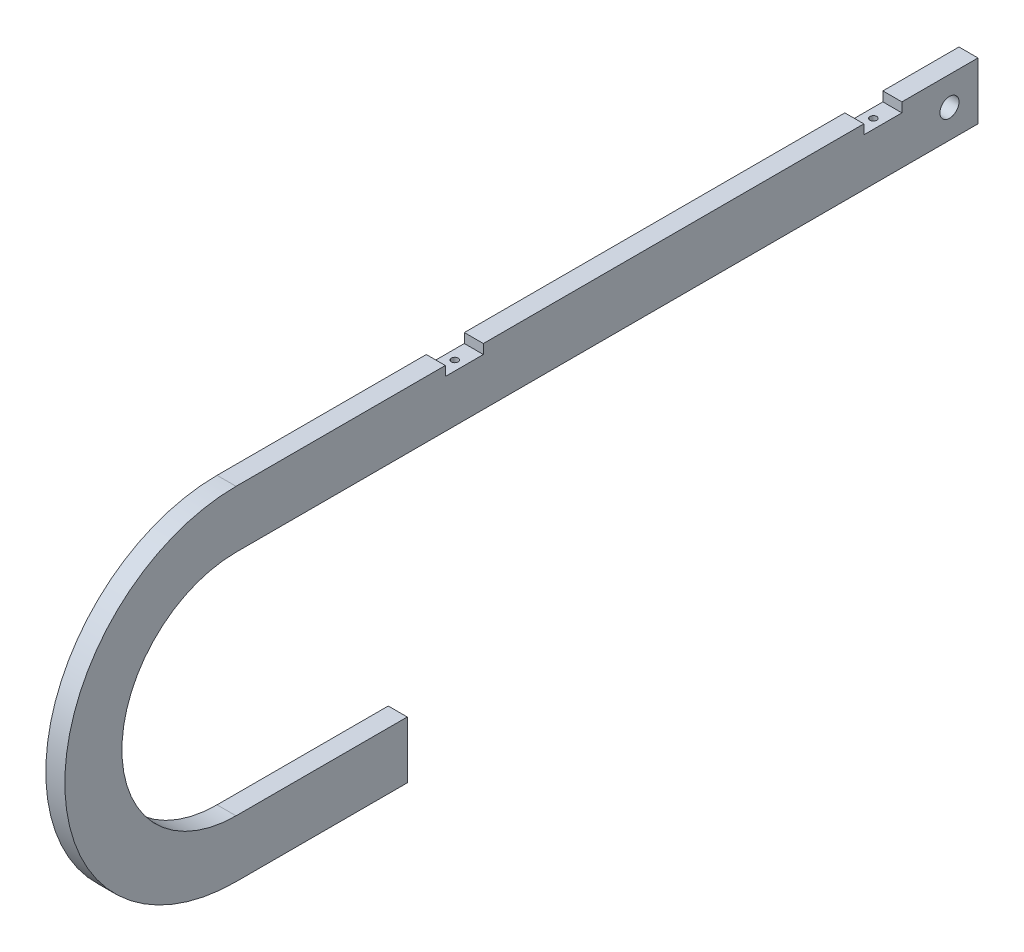
ISO-10303-21;
HEADER;
FILE_DESCRIPTION(('STEP AP214'),'2;1');
FILE_NAME('part.step','',(''),(''),'','','');
FILE_SCHEMA(('AUTOMOTIVE_DESIGN { 1 0 10303 214 1 1 1 1 }'));
ENDSEC;
DATA;
#1=APPLICATION_CONTEXT('core data for automotive mechanical design processes');
#2=APPLICATION_PROTOCOL_DEFINITION('international standard','automotive_design',2000,#1);
#3=PRODUCT_CONTEXT('',#1,'mechanical');
#4=PRODUCT('Part','Part','',(#3));
#5=PRODUCT_RELATED_PRODUCT_CATEGORY('part','',(#4));
#6=PRODUCT_DEFINITION_FORMATION('','',#4);
#7=PRODUCT_DEFINITION_CONTEXT('part definition',#1,'design');
#8=PRODUCT_DEFINITION('design','',#6,#7);
#9=PRODUCT_DEFINITION_SHAPE('','',#8);
#10=(LENGTH_UNIT() NAMED_UNIT(*) SI_UNIT(.MILLI.,.METRE.));
#11=(NAMED_UNIT(*) PLANE_ANGLE_UNIT() SI_UNIT($,.RADIAN.));
#12=(NAMED_UNIT(*) SI_UNIT($,.STERADIAN.) SOLID_ANGLE_UNIT());
#13=UNCERTAINTY_MEASURE_WITH_UNIT(LENGTH_MEASURE(1.E-05),#10,'distance_accuracy_value','');
#14=(GEOMETRIC_REPRESENTATION_CONTEXT(3) GLOBAL_UNCERTAINTY_ASSIGNED_CONTEXT((#13)) GLOBAL_UNIT_ASSIGNED_CONTEXT((#10,
#11,#12)) REPRESENTATION_CONTEXT('',''));
#15=CARTESIAN_POINT('',(0.,0.,0.));
#16=DIRECTION('',(0.,0.,1.));
#17=DIRECTION('',(1.,0.,0.));
#18=AXIS2_PLACEMENT_3D('',#15,#16,#17);
#19=CARTESIAN_POINT('',(3.175,0.,0.));
#20=DIRECTION('',(-1.,0.,0.));
#21=DIRECTION('',(0.,0.,1.));
#22=AXIS2_PLACEMENT_3D('',#19,#20,#21);
#23=CYLINDRICAL_SURFACE('',#22,57.15);
#24=CARTESIAN_POINT('',(-3.175,0.,0.));
#25=DIRECTION('',(1.,0.,0.));
#26=DIRECTION('',(0.,0.,-1.));
#27=AXIS2_PLACEMENT_3D('',#24,#25,#26);
#28=CIRCLE('',#27,57.15);
#29=CARTESIAN_POINT('',(-3.175,-57.15,0.));
#30=VERTEX_POINT('',#29);
#31=CARTESIAN_POINT('',(-3.175,57.15,0.));
#32=VERTEX_POINT('',#31);
#33=EDGE_CURVE('E225',#30,#32,#28,.F.);
#34=ORIENTED_EDGE('',*,*,#33,.F.);
#35=DIRECTION('',(-1.,0.,0.));
#36=VECTOR('',#35,1.);
#37=CARTESIAN_POINT('',(3.175,-57.15,0.));
#38=LINE('',#37,#36);
#39=CARTESIAN_POINT('',(3.175,-57.15,0.));
#40=VERTEX_POINT('',#39);
#41=EDGE_CURVE('E11',#40,#30,#38,.T.);
#42=ORIENTED_EDGE('',*,*,#41,.F.);
#43=CARTESIAN_POINT('',(3.175,0.,0.));
#44=DIRECTION('',(1.,0.,0.));
#45=DIRECTION('',(0.,0.,-1.));
#46=AXIS2_PLACEMENT_3D('',#43,#44,#45);
#47=CIRCLE('',#46,57.15);
#48=CARTESIAN_POINT('',(3.175,57.15,0.));
#49=VERTEX_POINT('',#48);
#50=EDGE_CURVE('E292',#40,#49,#47,.F.);
#51=ORIENTED_EDGE('',*,*,#50,.T.);
#52=DIRECTION('',(-1.,0.,0.));
#53=VECTOR('',#52,1.);
#54=CARTESIAN_POINT('',(3.175,57.15,0.));
#55=LINE('',#54,#53);
#56=EDGE_CURVE('E57',#49,#32,#55,.T.);
#57=ORIENTED_EDGE('',*,*,#56,.T.);
#58=EDGE_LOOP('',(#34,#42,#51,#57));
#59=FACE_BOUND('',#58,.T.);
#60=ADVANCED_FACE('F40',(#59),#23,.T.);
#61=CARTESIAN_POINT('',(3.175,-57.15,0.));
#62=DIRECTION('',(0.,-1.,0.));
#63=DIRECTION('',(0.,0.,-1.));
#64=AXIS2_PLACEMENT_3D('',#61,#62,#63);
#65=PLANE('',#64);
#66=DIRECTION('',(0.,0.,1.));
#67=VECTOR('',#66,1.);
#68=CARTESIAN_POINT('',(-3.175,-57.15,0.));
#69=LINE('',#68,#67);
#70=CARTESIAN_POINT('',(-3.175,-57.15,-57.15));
#71=VERTEX_POINT('',#70);
#72=EDGE_CURVE('E222',#71,#30,#69,.T.);
#73=ORIENTED_EDGE('',*,*,#72,.F.);
#74=DIRECTION('',(-1.,0.,0.));
#75=VECTOR('',#74,1.);
#76=CARTESIAN_POINT('',(3.175,-57.15,-57.15));
#77=LINE('',#76,#75);
#78=CARTESIAN_POINT('',(3.175,-57.15,-57.15));
#79=VERTEX_POINT('',#78);
#80=EDGE_CURVE('E49',#79,#71,#77,.T.);
#81=ORIENTED_EDGE('',*,*,#80,.F.);
#82=DIRECTION('',(0.,0.,1.));
#83=VECTOR('',#82,1.);
#84=CARTESIAN_POINT('',(3.175,-57.15,0.));
#85=LINE('',#84,#83);
#86=EDGE_CURVE('E290',#79,#40,#85,.T.);
#87=ORIENTED_EDGE('',*,*,#86,.T.);
#88=ORIENTED_EDGE('',*,*,#41,.T.);
#89=EDGE_LOOP('',(#73,#81,#87,#88));
#90=FACE_BOUND('',#89,.T.);
#91=ADVANCED_FACE('F223',(#90),#65,.T.);
#92=CARTESIAN_POINT('',(3.175,0.,-57.15));
#93=DIRECTION('',(0.,0.,-1.));
#94=DIRECTION('',(-1.,0.,0.));
#95=AXIS2_PLACEMENT_3D('',#92,#93,#94);
#96=PLANE('',#95);
#97=DIRECTION('',(0.,-1.,0.));
#98=VECTOR('',#97,1.);
#99=CARTESIAN_POINT('',(-3.175,0.,-57.15));
#100=LINE('',#99,#98);
#101=CARTESIAN_POINT('',(-3.175,-38.1,-57.15));
#102=VERTEX_POINT('',#101);
#103=EDGE_CURVE('E214',#102,#71,#100,.T.);
#104=ORIENTED_EDGE('',*,*,#103,.F.);
#105=DIRECTION('',(-1.,0.,0.));
#106=VECTOR('',#105,1.);
#107=CARTESIAN_POINT('',(3.175,-38.1,-57.15));
#108=LINE('',#107,#106);
#109=CARTESIAN_POINT('',(3.175,-38.1,-57.15));
#110=VERTEX_POINT('',#109);
#111=EDGE_CURVE('E207',#110,#102,#108,.T.);
#112=ORIENTED_EDGE('',*,*,#111,.F.);
#113=DIRECTION('',(0.,-1.,0.));
#114=VECTOR('',#113,1.);
#115=CARTESIAN_POINT('',(3.175,0.,-57.15));
#116=LINE('',#115,#114);
#117=EDGE_CURVE('E217',#110,#79,#116,.T.);
#118=ORIENTED_EDGE('',*,*,#117,.T.);
#119=ORIENTED_EDGE('',*,*,#80,.T.);
#120=EDGE_LOOP('',(#104,#112,#118,#119));
#121=FACE_BOUND('',#120,.T.);
#122=ADVANCED_FACE('F212',(#121),#96,.T.);
#123=CARTESIAN_POINT('',(3.175,-38.1,0.));
#124=DIRECTION('',(0.,1.,0.));
#125=DIRECTION('',(0.,0.,1.));
#126=AXIS2_PLACEMENT_3D('',#123,#124,#125);
#127=PLANE('',#126);
#128=DIRECTION('',(0.,0.,-1.));
#129=VECTOR('',#128,1.);
#130=CARTESIAN_POINT('',(-3.175,-38.1,0.));
#131=LINE('',#130,#129);
#132=CARTESIAN_POINT('',(-3.175,-38.1,0.));
#133=VERTEX_POINT('',#132);
#134=EDGE_CURVE('E230',#133,#102,#131,.T.);
#135=ORIENTED_EDGE('',*,*,#134,.F.);
#136=DIRECTION('',(-1.,0.,0.));
#137=VECTOR('',#136,1.);
#138=CARTESIAN_POINT('',(3.175,-38.1,0.));
#139=LINE('',#138,#137);
#140=CARTESIAN_POINT('',(3.175,-38.1,0.));
#141=VERTEX_POINT('',#140);
#142=EDGE_CURVE('E205',#141,#133,#139,.T.);
#143=ORIENTED_EDGE('',*,*,#142,.F.);
#144=DIRECTION('',(0.,0.,-1.));
#145=VECTOR('',#144,1.);
#146=CARTESIAN_POINT('',(3.175,-38.1,0.));
#147=LINE('',#146,#145);
#148=EDGE_CURVE('E286',#141,#110,#147,.T.);
#149=ORIENTED_EDGE('',*,*,#148,.T.);
#150=ORIENTED_EDGE('',*,*,#111,.T.);
#151=EDGE_LOOP('',(#135,#143,#149,#150));
#152=FACE_BOUND('',#151,.T.);
#153=ADVANCED_FACE('F332',(#152),#127,.T.);
#154=CARTESIAN_POINT('',(3.175,0.,0.));
#155=DIRECTION('',(-1.,0.,0.));
#156=DIRECTION('',(0.,0.,1.));
#157=AXIS2_PLACEMENT_3D('',#154,#155,#156);
#158=CYLINDRICAL_SURFACE('',#157,38.1);
#159=CARTESIAN_POINT('',(-3.175,0.,0.));
#160=DIRECTION('',(1.,0.,0.));
#161=DIRECTION('',(0.,0.,-1.));
#162=AXIS2_PLACEMENT_3D('',#159,#160,#161);
#163=CIRCLE('',#162,38.1);
#164=CARTESIAN_POINT('',(-3.175,38.1,0.));
#165=VERTEX_POINT('',#164);
#166=EDGE_CURVE('E232',#133,#165,#163,.F.);
#167=ORIENTED_EDGE('',*,*,#166,.T.);
#168=DIRECTION('',(-1.,0.,0.));
#169=VECTOR('',#168,1.);
#170=CARTESIAN_POINT('',(3.175,38.1,0.));
#171=LINE('',#170,#169);
#172=CARTESIAN_POINT('',(3.175,38.1,0.));
#173=VERTEX_POINT('',#172);
#174=EDGE_CURVE('E202',#173,#165,#171,.T.);
#175=ORIENTED_EDGE('',*,*,#174,.F.);
#176=CARTESIAN_POINT('',(3.175,0.,0.));
#177=DIRECTION('',(1.,0.,0.));
#178=DIRECTION('',(0.,0.,-1.));
#179=AXIS2_PLACEMENT_3D('',#176,#177,#178);
#180=CIRCLE('',#179,38.1);
#181=EDGE_CURVE('E281',#141,#173,#180,.F.);
#182=ORIENTED_EDGE('',*,*,#181,.F.);
#183=ORIENTED_EDGE('',*,*,#142,.T.);
#184=EDGE_LOOP('',(#167,#175,#182,#183));
#185=FACE_BOUND('',#184,.T.);
#186=ADVANCED_FACE('F335',(#185),#158,.F.);
#187=CARTESIAN_POINT('',(3.175,38.1,0.));
#188=DIRECTION('',(0.,1.,0.));
#189=DIRECTION('',(0.,0.,1.));
#190=AXIS2_PLACEMENT_3D('',#187,#188,#189);
#191=PLANE('',#190);
#192=DIRECTION('',(0.,0.,-1.));
#193=VECTOR('',#192,1.);
#194=CARTESIAN_POINT('',(-3.175,38.1,0.));
#195=LINE('',#194,#193);
#196=CARTESIAN_POINT('',(-3.175,38.1,-247.65));
#197=VERTEX_POINT('',#196);
#198=EDGE_CURVE('E238',#165,#197,#195,.T.);
#199=ORIENTED_EDGE('',*,*,#198,.T.);
#200=DIRECTION('',(-1.,0.,0.));
#201=VECTOR('',#200,1.);
#202=CARTESIAN_POINT('',(3.175,38.1,-247.65));
#203=LINE('',#202,#201);
#204=CARTESIAN_POINT('',(3.175,38.1,-247.65));
#205=VERTEX_POINT('',#204);
#206=EDGE_CURVE('E200',#205,#197,#203,.T.);
#207=ORIENTED_EDGE('',*,*,#206,.F.);
#208=DIRECTION('',(0.,0.,-1.));
#209=VECTOR('',#208,1.);
#210=CARTESIAN_POINT('',(3.175,38.1,0.));
#211=LINE('',#210,#209);
#212=EDGE_CURVE('E278',#173,#205,#211,.T.);
#213=ORIENTED_EDGE('',*,*,#212,.F.);
#214=ORIENTED_EDGE('',*,*,#174,.T.);
#215=EDGE_LOOP('',(#199,#207,#213,#214));
#216=FACE_BOUND('',#215,.T.);
#217=ADVANCED_FACE('F339',(#216),#191,.F.);
#218=CARTESIAN_POINT('',(3.175,0.,-247.65));
#219=DIRECTION('',(0.,0.,-1.));
#220=DIRECTION('',(-1.,0.,0.));
#221=AXIS2_PLACEMENT_3D('',#218,#219,#220);
#222=PLANE('',#221);
#223=DIRECTION('',(0.,-1.,0.));
#224=VECTOR('',#223,1.);
#225=CARTESIAN_POINT('',(-3.175,0.,-247.65));
#226=LINE('',#225,#224);
#227=CARTESIAN_POINT('',(-3.175,57.15,-247.65));
#228=VERTEX_POINT('',#227);
#229=EDGE_CURVE('E241',#228,#197,#226,.T.);
#230=ORIENTED_EDGE('',*,*,#229,.F.);
#231=DIRECTION('',(-1.,0.,0.));
#232=VECTOR('',#231,1.);
#233=CARTESIAN_POINT('',(3.175,57.15,-247.65));
#234=LINE('',#233,#232);
#235=CARTESIAN_POINT('',(3.175,57.15,-247.65));
#236=VERTEX_POINT('',#235);
#237=EDGE_CURVE('E198',#236,#228,#234,.T.);
#238=ORIENTED_EDGE('',*,*,#237,.F.);
#239=DIRECTION('',(0.,-1.,0.));
#240=VECTOR('',#239,1.);
#241=CARTESIAN_POINT('',(3.175,0.,-247.65));
#242=LINE('',#241,#240);
#243=EDGE_CURVE('E272',#236,#205,#242,.T.);
#244=ORIENTED_EDGE('',*,*,#243,.T.);
#245=ORIENTED_EDGE('',*,*,#206,.T.);
#246=EDGE_LOOP('',(#230,#238,#244,#245));
#247=FACE_BOUND('',#246,.T.);
#248=ADVANCED_FACE('F343',(#247),#222,.T.);
#249=CARTESIAN_POINT('',(3.175,57.15,0.));
#250=DIRECTION('',(0.,1.,0.));
#251=DIRECTION('',(0.,0.,1.));
#252=AXIS2_PLACEMENT_3D('',#249,#250,#251);
#253=PLANE('',#252);
#254=DIRECTION('',(0.,0.,-1.));
#255=VECTOR('',#254,1.);
#256=CARTESIAN_POINT('',(-3.175,57.15,0.));
#257=LINE('',#256,#255);
#258=CARTESIAN_POINT('',(-3.175,57.15,-222.25));
#259=VERTEX_POINT('',#258);
#260=EDGE_CURVE('E244',#259,#228,#257,.T.);
#261=ORIENTED_EDGE('',*,*,#260,.F.);
#262=DIRECTION('',(-1.,0.,0.));
#263=VECTOR('',#262,1.);
#264=CARTESIAN_POINT('',(3.175,57.15,-222.25));
#265=LINE('',#264,#263);
#266=CARTESIAN_POINT('',(3.175,57.15,-222.25));
#267=VERTEX_POINT('',#266);
#268=EDGE_CURVE('E196',#267,#259,#265,.T.);
#269=ORIENTED_EDGE('',*,*,#268,.F.);
#270=DIRECTION('',(0.,0.,-1.));
#271=VECTOR('',#270,1.);
#272=CARTESIAN_POINT('',(3.175,57.15,0.));
#273=LINE('',#272,#271);
#274=EDGE_CURVE('E265',#267,#236,#273,.T.);
#275=ORIENTED_EDGE('',*,*,#274,.T.);
#276=ORIENTED_EDGE('',*,*,#237,.T.);
#277=EDGE_LOOP('',(#261,#269,#275,#276));
#278=FACE_BOUND('',#277,.T.);
#279=ADVANCED_FACE('F347',(#278),#253,.T.);
#280=CARTESIAN_POINT('',(3.175,-1.94289029309404E-12,-222.25));
#281=DIRECTION('',(0.,0.,-1.));
#282=DIRECTION('',(0.,1.,0.));
#283=AXIS2_PLACEMENT_3D('',#280,#281,#282);
#284=PLANE('',#283);
#285=DIRECTION('',(0.,-1.,0.));
#286=VECTOR('',#285,1.);
#287=CARTESIAN_POINT('',(-3.175,-1.94289029309404E-12,-222.25));
#288=LINE('',#287,#286);
#289=CARTESIAN_POINT('',(-3.175,53.975,-222.25));
#290=VERTEX_POINT('',#289);
#291=EDGE_CURVE('E247',#259,#290,#288,.T.);
#292=ORIENTED_EDGE('',*,*,#291,.T.);
#293=DIRECTION('',(-1.,0.,0.));
#294=VECTOR('',#293,1.);
#295=CARTESIAN_POINT('',(3.175,53.975,-222.25));
#296=LINE('',#295,#294);
#297=CARTESIAN_POINT('',(3.175,53.975,-222.25));
#298=VERTEX_POINT('',#297);
#299=EDGE_CURVE('E193',#298,#290,#296,.T.);
#300=ORIENTED_EDGE('',*,*,#299,.F.);
#301=DIRECTION('',(0.,-1.,0.));
#302=VECTOR('',#301,1.);
#303=CARTESIAN_POINT('',(3.175,-1.94289029309404E-12,-222.25));
#304=LINE('',#303,#302);
#305=EDGE_CURVE('E271',#267,#298,#304,.T.);
#306=ORIENTED_EDGE('',*,*,#305,.F.);
#307=ORIENTED_EDGE('',*,*,#268,.T.);
#308=EDGE_LOOP('',(#292,#300,#306,#307));
#309=FACE_BOUND('',#308,.T.);
#310=ADVANCED_FACE('F348',(#309),#284,.F.);
#311=CARTESIAN_POINT('',(3.175,53.975,0.));
#312=DIRECTION('',(0.,-1.,0.));
#313=DIRECTION('',(0.,0.,-1.));
#314=AXIS2_PLACEMENT_3D('',#311,#312,#313);
#315=PLANE('',#314);
#316=CARTESIAN_POINT('',(0.,53.975,-215.9));
#317=DIRECTION('',(0.,1.,0.));
#318=DIRECTION('',(0.,0.,1.));
#319=AXIS2_PLACEMENT_3D('',#316,#317,#318);
#320=CIRCLE('',#319,1.13029999999999);
#321=CARTESIAN_POINT('',(0.,53.975,-214.7697));
#322=VERTEX_POINT('',#321);
#323=EDGE_CURVE('E301',#322,#322,#320,.T.);
#324=ORIENTED_EDGE('',*,*,#323,.F.);
#325=EDGE_LOOP('',(#324));
#326=FACE_BOUND('',#325,.T.);
#327=DIRECTION('',(0.,0.,1.));
#328=VECTOR('',#327,1.);
#329=CARTESIAN_POINT('',(-3.175,53.975,0.));
#330=LINE('',#329,#328);
#331=CARTESIAN_POINT('',(-3.175,53.975,-209.55));
#332=VERTEX_POINT('',#331);
#333=EDGE_CURVE('E252',#290,#332,#330,.T.);
#334=ORIENTED_EDGE('',*,*,#333,.T.);
#335=DIRECTION('',(-1.,0.,0.));
#336=VECTOR('',#335,1.);
#337=CARTESIAN_POINT('',(3.175,53.975,-209.55));
#338=LINE('',#337,#336);
#339=CARTESIAN_POINT('',(3.175,53.975,-209.55));
#340=VERTEX_POINT('',#339);
#341=EDGE_CURVE('E190',#340,#332,#338,.T.);
#342=ORIENTED_EDGE('',*,*,#341,.F.);
#343=DIRECTION('',(0.,0.,1.));
#344=VECTOR('',#343,1.);
#345=CARTESIAN_POINT('',(3.175,53.975,0.));
#346=LINE('',#345,#344);
#347=EDGE_CURVE('E276',#298,#340,#346,.T.);
#348=ORIENTED_EDGE('',*,*,#347,.F.);
#349=ORIENTED_EDGE('',*,*,#299,.T.);
#350=EDGE_LOOP('',(#334,#342,#348,#349));
#351=FACE_BOUND('',#350,.T.);
#352=ADVANCED_FACE('F351',(#326,#351),#315,.F.);
#353=CARTESIAN_POINT('',(3.175,0.,-209.55));
#354=DIRECTION('',(0.,0.,1.));
#355=DIRECTION('',(1.,0.,0.));
#356=AXIS2_PLACEMENT_3D('',#353,#354,#355);
#357=PLANE('',#356);
#358=DIRECTION('',(0.,1.,0.));
#359=VECTOR('',#358,1.);
#360=CARTESIAN_POINT('',(-3.175,0.,-209.55));
#361=LINE('',#360,#359);
#362=CARTESIAN_POINT('',(-3.175,57.15,-209.55));
#363=VERTEX_POINT('',#362);
#364=EDGE_CURVE('E255',#332,#363,#361,.T.);
#365=ORIENTED_EDGE('',*,*,#364,.T.);
#366=DIRECTION('',(-1.,0.,0.));
#367=VECTOR('',#366,1.);
#368=CARTESIAN_POINT('',(3.175,57.15,-209.55));
#369=LINE('',#368,#367);
#370=CARTESIAN_POINT('',(3.175,57.15,-209.55));
#371=VERTEX_POINT('',#370);
#372=EDGE_CURVE('E188',#371,#363,#369,.T.);
#373=ORIENTED_EDGE('',*,*,#372,.F.);
#374=DIRECTION('',(0.,1.,0.));
#375=VECTOR('',#374,1.);
#376=CARTESIAN_POINT('',(3.175,0.,-209.55));
#377=LINE('',#376,#375);
#378=EDGE_CURVE('E269',#340,#371,#377,.T.);
#379=ORIENTED_EDGE('',*,*,#378,.F.);
#380=ORIENTED_EDGE('',*,*,#341,.T.);
#381=EDGE_LOOP('',(#365,#373,#379,#380));
#382=FACE_BOUND('',#381,.T.);
#383=ADVANCED_FACE('F355',(#382),#357,.F.);
#384=CARTESIAN_POINT('',(-3.175,57.15,-82.5500000000001));
#385=VERTEX_POINT('',#384);
#386=EDGE_CURVE('E249',#385,#363,#257,.T.);
#387=ORIENTED_EDGE('',*,*,#386,.F.);
#388=DIRECTION('',(-1.,0.,0.));
#389=VECTOR('',#388,1.);
#390=CARTESIAN_POINT('',(3.175,57.15,-82.5500000000001));
#391=LINE('',#390,#389);
#392=CARTESIAN_POINT('',(3.175,57.15,-82.5500000000001));
#393=VERTEX_POINT('',#392);
#394=EDGE_CURVE('E182',#393,#385,#391,.T.);
#395=ORIENTED_EDGE('',*,*,#394,.F.);
#396=EDGE_CURVE('E264',#393,#371,#273,.T.);
#397=ORIENTED_EDGE('',*,*,#396,.T.);
#398=ORIENTED_EDGE('',*,*,#372,.T.);
#399=EDGE_LOOP('',(#387,#395,#397,#398));
#400=FACE_BOUND('',#399,.T.);
#401=ADVANCED_FACE('F321',(#400),#253,.T.);
#402=CARTESIAN_POINT('',(3.175,7.21644966006361E-13,-82.5500000000006));
#403=DIRECTION('',(0.,0.,-1.));
#404=DIRECTION('',(0.,1.,0.));
#405=AXIS2_PLACEMENT_3D('',#402,#403,#404);
#406=PLANE('',#405);
#407=DIRECTION('',(0.,-1.,0.));
#408=VECTOR('',#407,1.);
#409=CARTESIAN_POINT('',(-3.175,7.21644966006361E-13,-82.5500000000006));
#410=LINE('',#409,#408);
#411=CARTESIAN_POINT('',(-3.175,53.975,-82.5500000000001));
#412=VERTEX_POINT('',#411);
#413=EDGE_CURVE('E258',#385,#412,#410,.T.);
#414=ORIENTED_EDGE('',*,*,#413,.T.);
#415=DIRECTION('',(-1.,0.,0.));
#416=VECTOR('',#415,1.);
#417=CARTESIAN_POINT('',(3.175,53.975,-82.5500000000001));
#418=LINE('',#417,#416);
#419=CARTESIAN_POINT('',(3.175,53.975,-82.5500000000001));
#420=VERTEX_POINT('',#419);
#421=EDGE_CURVE('E180',#420,#412,#418,.T.);
#422=ORIENTED_EDGE('',*,*,#421,.F.);
#423=DIRECTION('',(0.,-1.,0.));
#424=VECTOR('',#423,1.);
#425=CARTESIAN_POINT('',(3.175,7.21644966006361E-13,-82.5500000000006));
#426=LINE('',#425,#424);
#427=EDGE_CURVE('E173',#393,#420,#426,.T.);
#428=ORIENTED_EDGE('',*,*,#427,.F.);
#429=ORIENTED_EDGE('',*,*,#394,.T.);
#430=EDGE_LOOP('',(#414,#422,#428,#429));
#431=FACE_BOUND('',#430,.T.);
#432=ADVANCED_FACE('F314',(#431),#406,.F.);
#433=CARTESIAN_POINT('',(3.175,53.975,0.));
#434=DIRECTION('',(0.,-1.,0.));
#435=DIRECTION('',(0.,0.,-1.));
#436=AXIS2_PLACEMENT_3D('',#433,#434,#435);
#437=PLANE('',#436);
#438=CARTESIAN_POINT('',(0.,53.975,-76.2000000000001));
#439=DIRECTION('',(0.,1.,0.));
#440=DIRECTION('',(0.,0.,1.));
#441=AXIS2_PLACEMENT_3D('',#438,#439,#440);
#442=CIRCLE('',#441,1.13029999999999);
#443=CARTESIAN_POINT('',(0.,53.975,-75.0697000000001));
#444=VERTEX_POINT('',#443);
#445=EDGE_CURVE('E307',#444,#444,#442,.T.);
#446=ORIENTED_EDGE('',*,*,#445,.F.);
#447=EDGE_LOOP('',(#446));
#448=FACE_BOUND('',#447,.T.);
#449=DIRECTION('',(0.,0.,1.));
#450=VECTOR('',#449,1.);
#451=CARTESIAN_POINT('',(-3.175,53.975,0.));
#452=LINE('',#451,#450);
#453=CARTESIAN_POINT('',(-3.175,53.975,-69.8500000000001));
#454=VERTEX_POINT('',#453);
#455=EDGE_CURVE('E179',#412,#454,#452,.T.);
#456=ORIENTED_EDGE('',*,*,#455,.T.);
#457=DIRECTION('',(-1.,0.,0.));
#458=VECTOR('',#457,1.);
#459=CARTESIAN_POINT('',(3.175,53.975,-69.8500000000001));
#460=LINE('',#459,#458);
#461=CARTESIAN_POINT('',(3.175,53.975,-69.8500000000001));
#462=VERTEX_POINT('',#461);
#463=EDGE_CURVE('E162',#462,#454,#460,.T.);
#464=ORIENTED_EDGE('',*,*,#463,.F.);
#465=DIRECTION('',(0.,0.,1.));
#466=VECTOR('',#465,1.);
#467=CARTESIAN_POINT('',(3.175,53.975,0.));
#468=LINE('',#467,#466);
#469=EDGE_CURVE('E167',#420,#462,#468,.T.);
#470=ORIENTED_EDGE('',*,*,#469,.F.);
#471=ORIENTED_EDGE('',*,*,#421,.T.);
#472=EDGE_LOOP('',(#456,#464,#470,#471));
#473=FACE_BOUND('',#472,.T.);
#474=ADVANCED_FACE('F178',(#448,#473),#437,.F.);
#475=CARTESIAN_POINT('',(3.175,3.05311331771921E-13,-69.8500000000003));
#476=DIRECTION('',(0.,0.,1.));
#477=DIRECTION('',(0.,-1.,0.));
#478=AXIS2_PLACEMENT_3D('',#475,#476,#477);
#479=PLANE('',#478);
#480=DIRECTION('',(0.,1.,0.));
#481=VECTOR('',#480,1.);
#482=CARTESIAN_POINT('',(-3.175,3.05311331771921E-13,-69.8500000000003));
#483=LINE('',#482,#481);
#484=CARTESIAN_POINT('',(-3.175,57.15,-69.8500000000001));
#485=VERTEX_POINT('',#484);
#486=EDGE_CURVE('E262',#454,#485,#483,.T.);
#487=ORIENTED_EDGE('',*,*,#486,.T.);
#488=DIRECTION('',(-1.,0.,0.));
#489=VECTOR('',#488,1.);
#490=CARTESIAN_POINT('',(3.175,57.15,-69.8500000000001));
#491=LINE('',#490,#489);
#492=CARTESIAN_POINT('',(3.175,57.15,-69.8500000000001));
#493=VERTEX_POINT('',#492);
#494=EDGE_CURVE('E108',#493,#485,#491,.T.);
#495=ORIENTED_EDGE('',*,*,#494,.F.);
#496=DIRECTION('',(0.,1.,0.));
#497=VECTOR('',#496,1.);
#498=CARTESIAN_POINT('',(3.175,3.05311331771921E-13,-69.8500000000003));
#499=LINE('',#498,#497);
#500=EDGE_CURVE('E158',#462,#493,#499,.T.);
#501=ORIENTED_EDGE('',*,*,#500,.F.);
#502=ORIENTED_EDGE('',*,*,#463,.T.);
#503=EDGE_LOOP('',(#487,#495,#501,#502));
#504=FACE_BOUND('',#503,.T.);
#505=ADVANCED_FACE('F160',(#504),#479,.F.);
#506=CARTESIAN_POINT('',(3.175,47.625,-238.125));
#507=DIRECTION('',(-1.,0.,0.));
#508=DIRECTION('',(0.,0.,1.));
#509=AXIS2_PLACEMENT_3D('',#506,#507,#508);
#510=CYLINDRICAL_SURFACE('',#509,3.17499999999997);
#511=CARTESIAN_POINT('',(3.175,47.625,-238.125));
#512=DIRECTION('',(1.,0.,0.));
#513=DIRECTION('',(0.,0.,-1.));
#514=AXIS2_PLACEMENT_3D('',#511,#512,#513);
#515=CIRCLE('',#514,3.17499999999997);
#516=CARTESIAN_POINT('',(3.175,47.625,-241.3));
#517=VERTEX_POINT('',#516);
#518=EDGE_CURVE('E294',#517,#517,#515,.T.);
#519=ORIENTED_EDGE('',*,*,#518,.T.);
#520=EDGE_LOOP('',(#519));
#521=FACE_BOUND('',#520,.T.);
#522=CARTESIAN_POINT('',(-3.175,47.625,-238.125));
#523=DIRECTION('',(1.,0.,0.));
#524=DIRECTION('',(0.,0.,-1.));
#525=AXIS2_PLACEMENT_3D('',#522,#523,#524);
#526=CIRCLE('',#525,3.17499999999997);
#527=CARTESIAN_POINT('',(-3.175,47.625,-241.3));
#528=VERTEX_POINT('',#527);
#529=EDGE_CURVE('E300',#528,#528,#526,.T.);
#530=ORIENTED_EDGE('',*,*,#529,.F.);
#531=EDGE_LOOP('',(#530));
#532=FACE_BOUND('',#531,.T.);
#533=ADVANCED_FACE('F42',(#521,#532),#510,.F.);
#534=EDGE_CURVE('E248',#32,#485,#257,.T.);
#535=ORIENTED_EDGE('',*,*,#534,.F.);
#536=ORIENTED_EDGE('',*,*,#56,.F.);
#537=EDGE_CURVE('E166',#49,#493,#273,.T.);
#538=ORIENTED_EDGE('',*,*,#537,.T.);
#539=ORIENTED_EDGE('',*,*,#494,.T.);
#540=EDGE_LOOP('',(#535,#536,#538,#539));
#541=FACE_BOUND('',#540,.T.);
#542=ADVANCED_FACE('F364',(#541),#253,.T.);
#543=CARTESIAN_POINT('',(3.175,0.,0.));
#544=DIRECTION('',(1.,0.,0.));
#545=DIRECTION('',(0.,0.,-1.));
#546=AXIS2_PLACEMENT_3D('',#543,#544,#545);
#547=PLANE('',#546);
#548=ORIENTED_EDGE('',*,*,#518,.F.);
#549=EDGE_LOOP('',(#548));
#550=FACE_BOUND('',#549,.T.);
#551=ORIENTED_EDGE('',*,*,#50,.F.);
#552=ORIENTED_EDGE('',*,*,#86,.F.);
#553=ORIENTED_EDGE('',*,*,#117,.F.);
#554=ORIENTED_EDGE('',*,*,#148,.F.);
#555=ORIENTED_EDGE('',*,*,#181,.T.);
#556=ORIENTED_EDGE('',*,*,#212,.T.);
#557=ORIENTED_EDGE('',*,*,#243,.F.);
#558=ORIENTED_EDGE('',*,*,#274,.F.);
#559=ORIENTED_EDGE('',*,*,#305,.T.);
#560=ORIENTED_EDGE('',*,*,#347,.T.);
#561=ORIENTED_EDGE('',*,*,#378,.T.);
#562=ORIENTED_EDGE('',*,*,#396,.F.);
#563=ORIENTED_EDGE('',*,*,#427,.T.);
#564=ORIENTED_EDGE('',*,*,#469,.T.);
#565=ORIENTED_EDGE('',*,*,#500,.T.);
#566=ORIENTED_EDGE('',*,*,#537,.F.);
#567=EDGE_LOOP('',(#551,#552,#553,#554,#555,#556,#557,#558,#559,#560,#561,#562,#563,#564,#565,#566));
#568=FACE_BOUND('',#567,.T.);
#569=ADVANCED_FACE('F170',(#550,#568),#547,.T.);
#570=CARTESIAN_POINT('',(-3.175,0.,0.));
#571=DIRECTION('',(1.,0.,0.));
#572=DIRECTION('',(0.,0.,-1.));
#573=AXIS2_PLACEMENT_3D('',#570,#571,#572);
#574=PLANE('',#573);
#575=ORIENTED_EDGE('',*,*,#529,.T.);
#576=EDGE_LOOP('',(#575));
#577=FACE_BOUND('',#576,.T.);
#578=ORIENTED_EDGE('',*,*,#33,.T.);
#579=ORIENTED_EDGE('',*,*,#534,.T.);
#580=ORIENTED_EDGE('',*,*,#486,.F.);
#581=ORIENTED_EDGE('',*,*,#455,.F.);
#582=ORIENTED_EDGE('',*,*,#413,.F.);
#583=ORIENTED_EDGE('',*,*,#386,.T.);
#584=ORIENTED_EDGE('',*,*,#364,.F.);
#585=ORIENTED_EDGE('',*,*,#333,.F.);
#586=ORIENTED_EDGE('',*,*,#291,.F.);
#587=ORIENTED_EDGE('',*,*,#260,.T.);
#588=ORIENTED_EDGE('',*,*,#229,.T.);
#589=ORIENTED_EDGE('',*,*,#198,.F.);
#590=ORIENTED_EDGE('',*,*,#166,.F.);
#591=ORIENTED_EDGE('',*,*,#134,.T.);
#592=ORIENTED_EDGE('',*,*,#103,.T.);
#593=ORIENTED_EDGE('',*,*,#72,.T.);
#594=EDGE_LOOP('',(#578,#579,#580,#581,#582,#583,#584,#585,#586,#587,#588,#589,#590,#591,#592,#593));
#595=FACE_BOUND('',#594,.T.);
#596=ADVANCED_FACE('F227',(#577,#595),#574,.F.);
#597=CARTESIAN_POINT('',(0.,46.355,-215.9));
#598=DIRECTION('',(0.,1.,0.));
#599=DIRECTION('',(0.,0.,1.));
#600=AXIS2_PLACEMENT_3D('',#597,#598,#599);
#601=CONICAL_SURFACE('',#600,1.13029999999999,1.02974425867665);
#602=CARTESIAN_POINT('',(0.,45.6758472423132,-215.9));
#603=VERTEX_POINT('',#602);
#604=VERTEX_LOOP('',#603);
#605=FACE_BOUND('',#604,.T.);
#606=CARTESIAN_POINT('',(0.,46.355,-215.9));
#607=DIRECTION('',(0.,1.,0.));
#608=DIRECTION('',(0.,0.,1.));
#609=AXIS2_PLACEMENT_3D('',#606,#607,#608);
#610=CIRCLE('',#609,1.13029999999999);
#611=CARTESIAN_POINT('',(0.,46.355,-214.7697));
#612=VERTEX_POINT('',#611);
#613=EDGE_CURVE('E297',#612,#612,#610,.T.);
#614=ORIENTED_EDGE('',*,*,#613,.T.);
#615=EDGE_LOOP('',(#614));
#616=FACE_BOUND('',#615,.T.);
#617=ADVANCED_FACE('F403',(#605,#616),#601,.F.);
#618=CARTESIAN_POINT('',(0.,53.975,-215.9));
#619=DIRECTION('',(0.,1.,0.));
#620=DIRECTION('',(0.,0.,1.));
#621=AXIS2_PLACEMENT_3D('',#618,#619,#620);
#622=CYLINDRICAL_SURFACE('',#621,1.13029999999999);
#623=ORIENTED_EDGE('',*,*,#613,.F.);
#624=EDGE_LOOP('',(#623));
#625=FACE_BOUND('',#624,.T.);
#626=ORIENTED_EDGE('',*,*,#323,.T.);
#627=EDGE_LOOP('',(#626));
#628=FACE_BOUND('',#627,.T.);
#629=ADVANCED_FACE('F407',(#625,#628),#622,.F.);
#630=CARTESIAN_POINT('',(0.,46.355,-76.2000000000001));
#631=DIRECTION('',(0.,1.,0.));
#632=DIRECTION('',(0.,0.,1.));
#633=AXIS2_PLACEMENT_3D('',#630,#631,#632);
#634=CONICAL_SURFACE('',#633,1.13029999999999,1.02974425867665);
#635=CARTESIAN_POINT('',(0.,45.6758472423132,-76.2000000000001));
#636=VERTEX_POINT('',#635);
#637=VERTEX_LOOP('',#636);
#638=FACE_BOUND('',#637,.T.);
#639=CARTESIAN_POINT('',(0.,46.355,-76.2000000000001));
#640=DIRECTION('',(0.,1.,0.));
#641=DIRECTION('',(0.,0.,1.));
#642=AXIS2_PLACEMENT_3D('',#639,#640,#641);
#643=CIRCLE('',#642,1.13029999999999);
#644=CARTESIAN_POINT('',(0.,46.355,-75.0697000000001));
#645=VERTEX_POINT('',#644);
#646=EDGE_CURVE('E304',#645,#645,#643,.T.);
#647=ORIENTED_EDGE('',*,*,#646,.T.);
#648=EDGE_LOOP('',(#647));
#649=FACE_BOUND('',#648,.T.);
#650=ADVANCED_FACE('F413',(#638,#649),#634,.F.);
#651=CARTESIAN_POINT('',(0.,53.975,-76.2000000000001));
#652=DIRECTION('',(0.,1.,0.));
#653=DIRECTION('',(0.,0.,1.));
#654=AXIS2_PLACEMENT_3D('',#651,#652,#653);
#655=CYLINDRICAL_SURFACE('',#654,1.13029999999999);
#656=ORIENTED_EDGE('',*,*,#646,.F.);
#657=EDGE_LOOP('',(#656));
#658=FACE_BOUND('',#657,.T.);
#659=ORIENTED_EDGE('',*,*,#445,.T.);
#660=EDGE_LOOP('',(#659));
#661=FACE_BOUND('',#660,.T.);
#662=ADVANCED_FACE('F311',(#658,#661),#655,.F.);
#663=CLOSED_SHELL('',(#60,#91,#122,#153,#186,#217,#248,#279,#310,#352,#383,#401,#432,#474,#505,
#533,#542,#569,#596,#617,#629,#650,#662));
#664=MANIFOLD_SOLID_BREP('B2',#663);
#665=ADVANCED_BREP_SHAPE_REPRESENTATION('',(#18,#664),#14);
#666=SHAPE_DEFINITION_REPRESENTATION(#9,#665);
ENDSEC;
END-ISO-10303-21;
